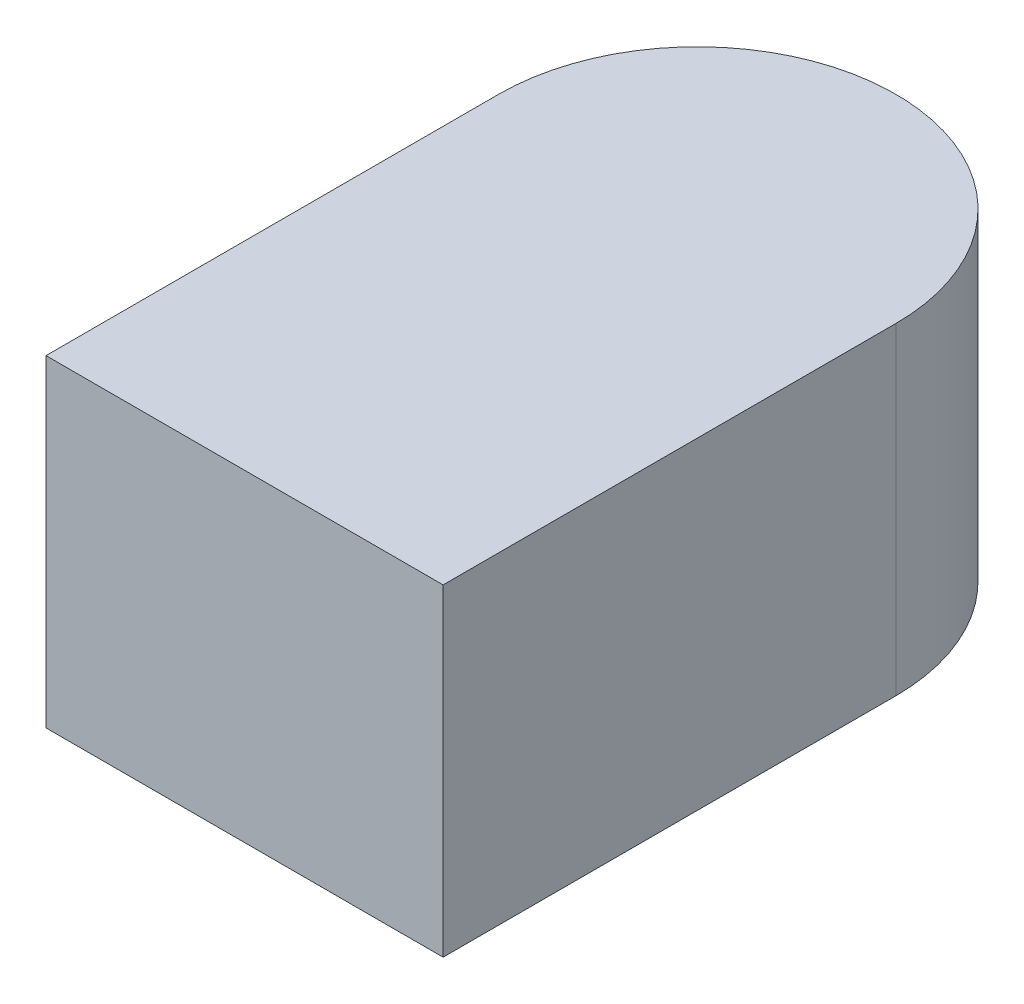
ISO-10303-21;
HEADER;
FILE_DESCRIPTION(('STEP AP214'),'2;1');
FILE_NAME('part.step','',(''),(''),'','','');
FILE_SCHEMA(('AUTOMOTIVE_DESIGN { 1 0 10303 214 1 1 1 1 }'));
ENDSEC;
DATA;
#1=APPLICATION_CONTEXT('core data for automotive mechanical design processes');
#2=APPLICATION_PROTOCOL_DEFINITION('international standard','automotive_design',2000,#1);
#3=PRODUCT_CONTEXT('',#1,'mechanical');
#4=PRODUCT('Part','Part','',(#3));
#5=PRODUCT_RELATED_PRODUCT_CATEGORY('part','',(#4));
#6=PRODUCT_DEFINITION_FORMATION('','',#4);
#7=PRODUCT_DEFINITION_CONTEXT('part definition',#1,'design');
#8=PRODUCT_DEFINITION('design','',#6,#7);
#9=PRODUCT_DEFINITION_SHAPE('','',#8);
#10=(LENGTH_UNIT() NAMED_UNIT(*) SI_UNIT(.MILLI.,.METRE.));
#11=(NAMED_UNIT(*) PLANE_ANGLE_UNIT() SI_UNIT($,.RADIAN.));
#12=(NAMED_UNIT(*) SI_UNIT($,.STERADIAN.) SOLID_ANGLE_UNIT());
#13=UNCERTAINTY_MEASURE_WITH_UNIT(LENGTH_MEASURE(1.E-05),#10,'distance_accuracy_value','');
#14=(GEOMETRIC_REPRESENTATION_CONTEXT(3) GLOBAL_UNCERTAINTY_ASSIGNED_CONTEXT((#13)) GLOBAL_UNIT_ASSIGNED_CONTEXT((#10,
#11,#12)) REPRESENTATION_CONTEXT('',''));
#15=CARTESIAN_POINT('',(0.,0.,0.));
#16=DIRECTION('',(0.,0.,1.));
#17=DIRECTION('',(1.,0.,0.));
#18=AXIS2_PLACEMENT_3D('',#15,#16,#17);
#19=CARTESIAN_POINT('',(0.125,0.203,-0.1425));
#20=DIRECTION('',(-1.,0.,0.));
#21=DIRECTION('',(0.,0.,1.));
#22=AXIS2_PLACEMENT_3D('',#19,#20,#21);
#23=PLANE('',#22);
#24=DIRECTION('',(0.,0.,-1.));
#25=VECTOR('',#24,1.);
#26=CARTESIAN_POINT('',(0.125,0.,-0.1425));
#27=LINE('',#26,#25);
#28=CARTESIAN_POINT('',(0.125,0.,0.1425));
#29=VERTEX_POINT('',#28);
#30=CARTESIAN_POINT('',(0.125,0.,-0.1425));
#31=VERTEX_POINT('',#30);
#32=EDGE_CURVE('E97',#29,#31,#27,.T.);
#33=ORIENTED_EDGE('',*,*,#32,.T.);
#34=DIRECTION('',(0.,-1.,0.));
#35=VECTOR('',#34,1.);
#36=CARTESIAN_POINT('',(0.125,0.203,-0.1425));
#37=LINE('',#36,#35);
#38=CARTESIAN_POINT('',(0.125,0.203,-0.1425));
#39=VERTEX_POINT('',#38);
#40=EDGE_CURVE('E11',#39,#31,#37,.T.);
#41=ORIENTED_EDGE('',*,*,#40,.F.);
#42=DIRECTION('',(0.,0.,-1.));
#43=VECTOR('',#42,1.);
#44=CARTESIAN_POINT('',(0.125,0.203,-0.1425));
#45=LINE('',#44,#43);
#46=CARTESIAN_POINT('',(0.125,0.203,0.1425));
#47=VERTEX_POINT('',#46);
#48=EDGE_CURVE('E85',#47,#39,#45,.T.);
#49=ORIENTED_EDGE('',*,*,#48,.F.);
#50=DIRECTION('',(0.,-1.,0.));
#51=VECTOR('',#50,1.);
#52=CARTESIAN_POINT('',(0.125,0.203,0.1425));
#53=LINE('',#52,#51);
#54=EDGE_CURVE('E93',#47,#29,#53,.T.);
#55=ORIENTED_EDGE('',*,*,#54,.T.);
#56=EDGE_LOOP('',(#33,#41,#49,#55));
#57=FACE_BOUND('',#56,.T.);
#58=ADVANCED_FACE('F34',(#57),#23,.F.);
#59=CARTESIAN_POINT('',(0.,0.203,-0.1425));
#60=DIRECTION('',(0.,-1.,0.));
#61=DIRECTION('',(0.,0.,-1.));
#62=AXIS2_PLACEMENT_3D('',#59,#60,#61);
#63=CYLINDRICAL_SURFACE('',#62,0.125);
#64=CARTESIAN_POINT('',(0.,0.,-0.1425));
#65=DIRECTION('',(0.,1.,0.));
#66=DIRECTION('',(0.,0.,1.));
#67=AXIS2_PLACEMENT_3D('',#64,#65,#66);
#68=CIRCLE('',#67,0.125);
#69=CARTESIAN_POINT('',(-0.125,0.,-0.1425));
#70=VERTEX_POINT('',#69);
#71=EDGE_CURVE('E89',#31,#70,#68,.T.);
#72=ORIENTED_EDGE('',*,*,#71,.T.);
#73=DIRECTION('',(0.,-1.,0.));
#74=VECTOR('',#73,1.);
#75=CARTESIAN_POINT('',(-0.125,0.203,-0.1425));
#76=LINE('',#75,#74);
#77=CARTESIAN_POINT('',(-0.125,0.203,-0.1425));
#78=VERTEX_POINT('',#77);
#79=EDGE_CURVE('E42',#78,#70,#76,.T.);
#80=ORIENTED_EDGE('',*,*,#79,.F.);
#81=CARTESIAN_POINT('',(0.,0.203,-0.1425));
#82=DIRECTION('',(0.,1.,0.));
#83=DIRECTION('',(0.,0.,1.));
#84=AXIS2_PLACEMENT_3D('',#81,#82,#83);
#85=CIRCLE('',#84,0.125);
#86=EDGE_CURVE('E80',#39,#78,#85,.T.);
#87=ORIENTED_EDGE('',*,*,#86,.F.);
#88=ORIENTED_EDGE('',*,*,#40,.T.);
#89=EDGE_LOOP('',(#72,#80,#87,#88));
#90=FACE_BOUND('',#89,.T.);
#91=ADVANCED_FACE('F88',(#90),#63,.T.);
#92=CARTESIAN_POINT('',(-0.125,0.203,-0.1425));
#93=DIRECTION('',(1.,0.,0.));
#94=DIRECTION('',(0.,0.,-1.));
#95=AXIS2_PLACEMENT_3D('',#92,#93,#94);
#96=PLANE('',#95);
#97=DIRECTION('',(0.,0.,1.));
#98=VECTOR('',#97,1.);
#99=CARTESIAN_POINT('',(-0.125,0.,-0.1425));
#100=LINE('',#99,#98);
#101=CARTESIAN_POINT('',(-0.125,0.,0.1425));
#102=VERTEX_POINT('',#101);
#103=EDGE_CURVE('E67',#70,#102,#100,.T.);
#104=ORIENTED_EDGE('',*,*,#103,.T.);
#105=DIRECTION('',(0.,-1.,0.));
#106=VECTOR('',#105,1.);
#107=CARTESIAN_POINT('',(-0.125,0.203,0.1425));
#108=LINE('',#107,#106);
#109=CARTESIAN_POINT('',(-0.125,0.203,0.1425));
#110=VERTEX_POINT('',#109);
#111=EDGE_CURVE('E90',#110,#102,#108,.T.);
#112=ORIENTED_EDGE('',*,*,#111,.F.);
#113=DIRECTION('',(0.,0.,1.));
#114=VECTOR('',#113,1.);
#115=CARTESIAN_POINT('',(-0.125,0.203,-0.1425));
#116=LINE('',#115,#114);
#117=EDGE_CURVE('E83',#78,#110,#116,.T.);
#118=ORIENTED_EDGE('',*,*,#117,.F.);
#119=ORIENTED_EDGE('',*,*,#79,.T.);
#120=EDGE_LOOP('',(#104,#112,#118,#119));
#121=FACE_BOUND('',#120,.T.);
#122=ADVANCED_FACE('F91',(#121),#96,.F.);
#123=CARTESIAN_POINT('',(-0.125,0.203,0.1425));
#124=DIRECTION('',(0.,0.,-1.));
#125=DIRECTION('',(-1.,0.,0.));
#126=AXIS2_PLACEMENT_3D('',#123,#124,#125);
#127=PLANE('',#126);
#128=DIRECTION('',(1.,0.,0.));
#129=VECTOR('',#128,1.);
#130=CARTESIAN_POINT('',(-0.125,0.,0.1425));
#131=LINE('',#130,#129);
#132=EDGE_CURVE('E73',#102,#29,#131,.T.);
#133=ORIENTED_EDGE('',*,*,#132,.T.);
#134=ORIENTED_EDGE('',*,*,#54,.F.);
#135=DIRECTION('',(1.,0.,0.));
#136=VECTOR('',#135,1.);
#137=CARTESIAN_POINT('',(-0.125,0.203,0.1425));
#138=LINE('',#137,#136);
#139=EDGE_CURVE('E50',#110,#47,#138,.T.);
#140=ORIENTED_EDGE('',*,*,#139,.F.);
#141=ORIENTED_EDGE('',*,*,#111,.T.);
#142=EDGE_LOOP('',(#133,#134,#140,#141));
#143=FACE_BOUND('',#142,.T.);
#144=ADVANCED_FACE('F104',(#143),#127,.F.);
#145=CARTESIAN_POINT('',(0.,0.203,-0.1425));
#146=DIRECTION('',(0.,1.,0.));
#147=DIRECTION('',(0.,0.,1.));
#148=AXIS2_PLACEMENT_3D('',#145,#146,#147);
#149=PLANE('',#148);
#150=ORIENTED_EDGE('',*,*,#48,.T.);
#151=ORIENTED_EDGE('',*,*,#86,.T.);
#152=ORIENTED_EDGE('',*,*,#117,.T.);
#153=ORIENTED_EDGE('',*,*,#139,.T.);
#154=EDGE_LOOP('',(#150,#151,#152,#153));
#155=FACE_BOUND('',#154,.T.);
#156=ADVANCED_FACE('F81',(#155),#149,.T.);
#157=CARTESIAN_POINT('',(0.,0.,-0.1425));
#158=DIRECTION('',(0.,1.,0.));
#159=DIRECTION('',(0.,0.,1.));
#160=AXIS2_PLACEMENT_3D('',#157,#158,#159);
#161=PLANE('',#160);
#162=ORIENTED_EDGE('',*,*,#32,.F.);
#163=ORIENTED_EDGE('',*,*,#132,.F.);
#164=ORIENTED_EDGE('',*,*,#103,.F.);
#165=ORIENTED_EDGE('',*,*,#71,.F.);
#166=EDGE_LOOP('',(#162,#163,#164,#165));
#167=FACE_BOUND('',#166,.T.);
#168=ADVANCED_FACE('F107',(#167),#161,.F.);
#169=CLOSED_SHELL('',(#58,#91,#122,#144,#156,#168));
#170=MANIFOLD_SOLID_BREP('B2',#169);
#171=ADVANCED_BREP_SHAPE_REPRESENTATION('',(#18,#170),#14);
#172=SHAPE_DEFINITION_REPRESENTATION(#9,#171);
ENDSEC;
END-ISO-10303-21;
